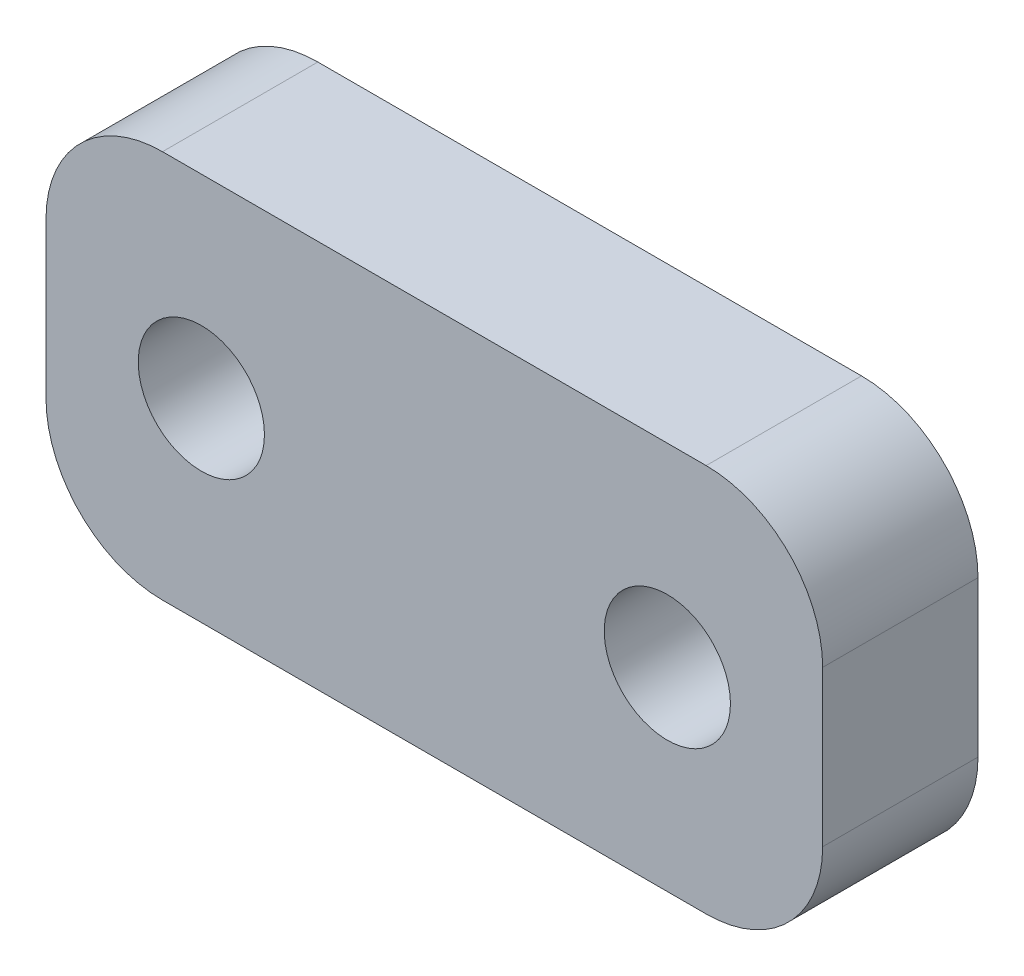
ISO-10303-21;
HEADER;
FILE_DESCRIPTION(('STEP AP214'),'2;1');
FILE_NAME('part.step','',(''),(''),'','','');
FILE_SCHEMA(('AUTOMOTIVE_DESIGN { 1 0 10303 214 1 1 1 1 }'));
ENDSEC;
DATA;
#1=APPLICATION_CONTEXT('core data for automotive mechanical design processes');
#2=APPLICATION_PROTOCOL_DEFINITION('international standard','automotive_design',2000,#1);
#3=PRODUCT_CONTEXT('',#1,'mechanical');
#4=PRODUCT('Part','Part','',(#3));
#5=PRODUCT_RELATED_PRODUCT_CATEGORY('part','',(#4));
#6=PRODUCT_DEFINITION_FORMATION('','',#4);
#7=PRODUCT_DEFINITION_CONTEXT('part definition',#1,'design');
#8=PRODUCT_DEFINITION('design','',#6,#7);
#9=PRODUCT_DEFINITION_SHAPE('','',#8);
#10=(LENGTH_UNIT() NAMED_UNIT(*) SI_UNIT(.MILLI.,.METRE.));
#11=(NAMED_UNIT(*) PLANE_ANGLE_UNIT() SI_UNIT($,.RADIAN.));
#12=(NAMED_UNIT(*) SI_UNIT($,.STERADIAN.) SOLID_ANGLE_UNIT());
#13=UNCERTAINTY_MEASURE_WITH_UNIT(LENGTH_MEASURE(1.E-05),#10,'distance_accuracy_value','');
#14=(GEOMETRIC_REPRESENTATION_CONTEXT(3) GLOBAL_UNCERTAINTY_ASSIGNED_CONTEXT((#13)) GLOBAL_UNIT_ASSIGNED_CONTEXT((#10,
#11,#12)) REPRESENTATION_CONTEXT('',''));
#15=CARTESIAN_POINT('',(0.,0.,0.));
#16=DIRECTION('',(0.,0.,1.));
#17=DIRECTION('',(1.,0.,0.));
#18=AXIS2_PLACEMENT_3D('',#15,#16,#17);
#19=CARTESIAN_POINT('',(0.,0.,4.));
#20=DIRECTION('',(0.,0.,-1.));
#21=DIRECTION('',(-1.,0.,0.));
#22=AXIS2_PLACEMENT_3D('',#19,#20,#21);
#23=PLANE('',#22);
#24=DIRECTION('',(0.,1.,0.));
#25=VECTOR('',#24,1.);
#26=CARTESIAN_POINT('',(10.,-5.00016331863466,4.));
#27=LINE('',#26,#25);
#28=CARTESIAN_POINT('',(10.,-2.00016331863466,4.));
#29=VERTEX_POINT('',#28);
#30=CARTESIAN_POINT('',(10.,2.00016331863466,4.));
#31=VERTEX_POINT('',#30);
#32=EDGE_CURVE('E136',#29,#31,#27,.T.);
#33=ORIENTED_EDGE('',*,*,#32,.T.);
#34=CARTESIAN_POINT('',(7.,2.00016331863466,4.));
#35=DIRECTION('',(0.,0.,-1.));
#36=DIRECTION('',(-1.,0.,0.));
#37=AXIS2_PLACEMENT_3D('',#34,#35,#36);
#38=CIRCLE('',#37,3.);
#39=CARTESIAN_POINT('',(7.,5.00016331863466,4.));
#40=VERTEX_POINT('',#39);
#41=EDGE_CURVE('E151',#31,#40,#38,.F.);
#42=ORIENTED_EDGE('',*,*,#41,.T.);
#43=DIRECTION('',(-1.,0.,0.));
#44=VECTOR('',#43,1.);
#45=CARTESIAN_POINT('',(-10.,5.00016331863466,4.));
#46=LINE('',#45,#44);
#47=CARTESIAN_POINT('',(-7.,5.00016331863466,4.));
#48=VERTEX_POINT('',#47);
#49=EDGE_CURVE('E118',#40,#48,#46,.T.);
#50=ORIENTED_EDGE('',*,*,#49,.T.);
#51=CARTESIAN_POINT('',(-7.,2.00016331863466,4.));
#52=DIRECTION('',(0.,0.,-1.));
#53=DIRECTION('',(-1.,0.,0.));
#54=AXIS2_PLACEMENT_3D('',#51,#52,#53);
#55=CIRCLE('',#54,3.);
#56=CARTESIAN_POINT('',(-10.,2.00016331863466,4.));
#57=VERTEX_POINT('',#56);
#58=EDGE_CURVE('E146',#48,#57,#55,.F.);
#59=ORIENTED_EDGE('',*,*,#58,.T.);
#60=DIRECTION('',(0.,-1.,0.));
#61=VECTOR('',#60,1.);
#62=CARTESIAN_POINT('',(-10.,-5.00016331863466,4.));
#63=LINE('',#62,#61);
#64=CARTESIAN_POINT('',(-10.,-2.00016331863466,4.));
#65=VERTEX_POINT('',#64);
#66=EDGE_CURVE('E162',#57,#65,#63,.T.);
#67=ORIENTED_EDGE('',*,*,#66,.T.);
#68=CARTESIAN_POINT('',(-7.,-2.00016331863466,4.));
#69=DIRECTION('',(0.,0.,-1.));
#70=DIRECTION('',(-1.,0.,0.));
#71=AXIS2_PLACEMENT_3D('',#68,#69,#70);
#72=CIRCLE('',#71,3.);
#73=CARTESIAN_POINT('',(-7.,-5.00016331863466,4.));
#74=VERTEX_POINT('',#73);
#75=EDGE_CURVE('E54',#65,#74,#72,.F.);
#76=ORIENTED_EDGE('',*,*,#75,.T.);
#77=DIRECTION('',(1.,0.,0.));
#78=VECTOR('',#77,1.);
#79=CARTESIAN_POINT('',(-10.,-5.00016331863466,4.));
#80=LINE('',#79,#78);
#81=CARTESIAN_POINT('',(7.,-5.00016331863466,4.));
#82=VERTEX_POINT('',#81);
#83=EDGE_CURVE('E137',#74,#82,#80,.T.);
#84=ORIENTED_EDGE('',*,*,#83,.T.);
#85=CARTESIAN_POINT('',(7.,-2.00016331863466,4.));
#86=DIRECTION('',(0.,0.,-1.));
#87=DIRECTION('',(-1.,0.,0.));
#88=AXIS2_PLACEMENT_3D('',#85,#86,#87);
#89=CIRCLE('',#88,3.);
#90=EDGE_CURVE('E149',#82,#29,#89,.F.);
#91=ORIENTED_EDGE('',*,*,#90,.T.);
#92=EDGE_LOOP('',(#33,#42,#50,#59,#67,#76,#84,#91));
#93=FACE_BOUND('',#92,.T.);
#94=CARTESIAN_POINT('',(-6.,0.,4.));
#95=DIRECTION('',(0.,0.,1.));
#96=DIRECTION('',(1.,0.,0.));
#97=AXIS2_PLACEMENT_3D('',#94,#95,#96);
#98=CIRCLE('',#97,1.625);
#99=CARTESIAN_POINT('',(-4.375,0.,4.));
#100=VERTEX_POINT('',#99);
#101=EDGE_CURVE('E131',#100,#100,#98,.T.);
#102=ORIENTED_EDGE('',*,*,#101,.F.);
#103=EDGE_LOOP('',(#102));
#104=FACE_BOUND('',#103,.T.);
#105=CARTESIAN_POINT('',(6.,0.,4.));
#106=DIRECTION('',(0.,0.,1.));
#107=DIRECTION('',(1.,0.,0.));
#108=AXIS2_PLACEMENT_3D('',#105,#106,#107);
#109=CIRCLE('',#108,1.625);
#110=CARTESIAN_POINT('',(7.625,0.,4.));
#111=VERTEX_POINT('',#110);
#112=EDGE_CURVE('E179',#111,#111,#109,.T.);
#113=ORIENTED_EDGE('',*,*,#112,.F.);
#114=EDGE_LOOP('',(#113));
#115=FACE_BOUND('',#114,.T.);
#116=ADVANCED_FACE('F32',(#93,#104,#115),#23,.F.);
#117=CARTESIAN_POINT('',(0.,0.,0.));
#118=DIRECTION('',(0.,0.,-1.));
#119=DIRECTION('',(-1.,0.,0.));
#120=AXIS2_PLACEMENT_3D('',#117,#118,#119);
#121=PLANE('',#120);
#122=CARTESIAN_POINT('',(-6.,0.,0.));
#123=DIRECTION('',(0.,0.,1.));
#124=DIRECTION('',(1.,0.,0.));
#125=AXIS2_PLACEMENT_3D('',#122,#123,#124);
#126=CIRCLE('',#125,1.625);
#127=CARTESIAN_POINT('',(-4.375,0.,0.));
#128=VERTEX_POINT('',#127);
#129=EDGE_CURVE('E176',#128,#128,#126,.T.);
#130=ORIENTED_EDGE('',*,*,#129,.T.);
#131=EDGE_LOOP('',(#130));
#132=FACE_BOUND('',#131,.T.);
#133=DIRECTION('',(-1.,0.,0.));
#134=VECTOR('',#133,1.);
#135=CARTESIAN_POINT('',(-10.,5.00016331863466,0.));
#136=LINE('',#135,#134);
#137=CARTESIAN_POINT('',(7.,5.00016331863466,0.));
#138=VERTEX_POINT('',#137);
#139=CARTESIAN_POINT('',(-7.,5.00016331863466,0.));
#140=VERTEX_POINT('',#139);
#141=EDGE_CURVE('E115',#138,#140,#136,.T.);
#142=ORIENTED_EDGE('',*,*,#141,.F.);
#143=CARTESIAN_POINT('',(7.,2.00016331863466,0.));
#144=DIRECTION('',(0.,0.,-1.));
#145=DIRECTION('',(-1.,0.,0.));
#146=AXIS2_PLACEMENT_3D('',#143,#144,#145);
#147=CIRCLE('',#146,3.);
#148=CARTESIAN_POINT('',(10.,2.00016331863466,0.));
#149=VERTEX_POINT('',#148);
#150=EDGE_CURVE('E98',#138,#149,#147,.T.);
#151=ORIENTED_EDGE('',*,*,#150,.T.);
#152=DIRECTION('',(0.,1.,0.));
#153=VECTOR('',#152,1.);
#154=CARTESIAN_POINT('',(10.,-5.00016331863466,0.));
#155=LINE('',#154,#153);
#156=CARTESIAN_POINT('',(10.,-2.00016331863466,0.));
#157=VERTEX_POINT('',#156);
#158=EDGE_CURVE('E126',#157,#149,#155,.T.);
#159=ORIENTED_EDGE('',*,*,#158,.F.);
#160=CARTESIAN_POINT('',(7.,-2.00016331863466,0.));
#161=DIRECTION('',(0.,0.,-1.));
#162=DIRECTION('',(-1.,0.,0.));
#163=AXIS2_PLACEMENT_3D('',#160,#161,#162);
#164=CIRCLE('',#163,3.);
#165=CARTESIAN_POINT('',(7.,-5.00016331863466,0.));
#166=VERTEX_POINT('',#165);
#167=EDGE_CURVE('E109',#157,#166,#164,.T.);
#168=ORIENTED_EDGE('',*,*,#167,.T.);
#169=DIRECTION('',(1.,0.,0.));
#170=VECTOR('',#169,1.);
#171=CARTESIAN_POINT('',(-10.,-5.00016331863466,0.));
#172=LINE('',#171,#170);
#173=CARTESIAN_POINT('',(-7.,-5.00016331863466,0.));
#174=VERTEX_POINT('',#173);
#175=EDGE_CURVE('E129',#174,#166,#172,.T.);
#176=ORIENTED_EDGE('',*,*,#175,.F.);
#177=CARTESIAN_POINT('',(-7.,-2.00016331863466,0.));
#178=DIRECTION('',(0.,0.,-1.));
#179=DIRECTION('',(-1.,0.,0.));
#180=AXIS2_PLACEMENT_3D('',#177,#178,#179);
#181=CIRCLE('',#180,3.);
#182=CARTESIAN_POINT('',(-10.,-2.00016331863466,0.));
#183=VERTEX_POINT('',#182);
#184=EDGE_CURVE('E140',#174,#183,#181,.T.);
#185=ORIENTED_EDGE('',*,*,#184,.T.);
#186=DIRECTION('',(0.,-1.,0.));
#187=VECTOR('',#186,1.);
#188=CARTESIAN_POINT('',(-10.,-5.00016331863466,0.));
#189=LINE('',#188,#187);
#190=CARTESIAN_POINT('',(-10.,2.00016331863466,0.));
#191=VERTEX_POINT('',#190);
#192=EDGE_CURVE('E125',#191,#183,#189,.T.);
#193=ORIENTED_EDGE('',*,*,#192,.F.);
#194=CARTESIAN_POINT('',(-7.,2.00016331863466,0.));
#195=DIRECTION('',(0.,0.,-1.));
#196=DIRECTION('',(-1.,0.,0.));
#197=AXIS2_PLACEMENT_3D('',#194,#195,#196);
#198=CIRCLE('',#197,3.);
#199=EDGE_CURVE('E119',#191,#140,#198,.T.);
#200=ORIENTED_EDGE('',*,*,#199,.T.);
#201=EDGE_LOOP('',(#142,#151,#159,#168,#176,#185,#193,#200));
#202=FACE_BOUND('',#201,.T.);
#203=CARTESIAN_POINT('',(6.,0.,0.));
#204=DIRECTION('',(0.,0.,1.));
#205=DIRECTION('',(1.,0.,0.));
#206=AXIS2_PLACEMENT_3D('',#203,#204,#205);
#207=CIRCLE('',#206,1.625);
#208=CARTESIAN_POINT('',(7.625,0.,0.));
#209=VERTEX_POINT('',#208);
#210=EDGE_CURVE('E182',#209,#209,#207,.T.);
#211=ORIENTED_EDGE('',*,*,#210,.T.);
#212=EDGE_LOOP('',(#211));
#213=FACE_BOUND('',#212,.T.);
#214=ADVANCED_FACE('F122',(#132,#202,#213),#121,.T.);
#215=CARTESIAN_POINT('',(10.,-5.00016331863466,4.));
#216=DIRECTION('',(-1.,0.,0.));
#217=DIRECTION('',(0.,0.,1.));
#218=AXIS2_PLACEMENT_3D('',#215,#216,#217);
#219=PLANE('',#218);
#220=ORIENTED_EDGE('',*,*,#158,.T.);
#221=DIRECTION('',(0.,0.,-1.));
#222=VECTOR('',#221,1.);
#223=CARTESIAN_POINT('',(10.,2.00016331863466,4.));
#224=LINE('',#223,#222);
#225=EDGE_CURVE('E103',#149,#31,#224,.F.);
#226=ORIENTED_EDGE('',*,*,#225,.T.);
#227=ORIENTED_EDGE('',*,*,#32,.F.);
#228=DIRECTION('',(0.,0.,-1.));
#229=VECTOR('',#228,1.);
#230=CARTESIAN_POINT('',(10.,-2.00016331863466,4.));
#231=LINE('',#230,#229);
#232=EDGE_CURVE('E108',#29,#157,#231,.T.);
#233=ORIENTED_EDGE('',*,*,#232,.T.);
#234=EDGE_LOOP('',(#220,#226,#227,#233));
#235=FACE_BOUND('',#234,.T.);
#236=ADVANCED_FACE('F197',(#235),#219,.F.);
#237=CARTESIAN_POINT('',(-10.,5.00016331863466,4.));
#238=DIRECTION('',(0.,-1.,0.));
#239=DIRECTION('',(0.,0.,-1.));
#240=AXIS2_PLACEMENT_3D('',#237,#238,#239);
#241=PLANE('',#240);
#242=ORIENTED_EDGE('',*,*,#49,.F.);
#243=DIRECTION('',(0.,0.,-1.));
#244=VECTOR('',#243,1.);
#245=CARTESIAN_POINT('',(7.,5.00016331863466,4.));
#246=LINE('',#245,#244);
#247=EDGE_CURVE('E102',#40,#138,#246,.T.);
#248=ORIENTED_EDGE('',*,*,#247,.T.);
#249=ORIENTED_EDGE('',*,*,#141,.T.);
#250=DIRECTION('',(0.,0.,-1.));
#251=VECTOR('',#250,1.);
#252=CARTESIAN_POINT('',(-7.,5.00016331863466,4.));
#253=LINE('',#252,#251);
#254=EDGE_CURVE('E120',#140,#48,#253,.F.);
#255=ORIENTED_EDGE('',*,*,#254,.T.);
#256=EDGE_LOOP('',(#242,#248,#249,#255));
#257=FACE_BOUND('',#256,.T.);
#258=ADVANCED_FACE('F114',(#257),#241,.F.);
#259=CARTESIAN_POINT('',(-10.,-5.00016331863466,4.));
#260=DIRECTION('',(1.,0.,0.));
#261=DIRECTION('',(0.,0.,-1.));
#262=AXIS2_PLACEMENT_3D('',#259,#260,#261);
#263=PLANE('',#262);
#264=ORIENTED_EDGE('',*,*,#192,.T.);
#265=DIRECTION('',(0.,0.,-1.));
#266=VECTOR('',#265,1.);
#267=CARTESIAN_POINT('',(-10.,-2.00016331863466,4.));
#268=LINE('',#267,#266);
#269=EDGE_CURVE('E11',#183,#65,#268,.F.);
#270=ORIENTED_EDGE('',*,*,#269,.T.);
#271=ORIENTED_EDGE('',*,*,#66,.F.);
#272=DIRECTION('',(0.,0.,-1.));
#273=VECTOR('',#272,1.);
#274=CARTESIAN_POINT('',(-10.,2.00016331863466,4.));
#275=LINE('',#274,#273);
#276=EDGE_CURVE('E40',#57,#191,#275,.T.);
#277=ORIENTED_EDGE('',*,*,#276,.T.);
#278=EDGE_LOOP('',(#264,#270,#271,#277));
#279=FACE_BOUND('',#278,.T.);
#280=ADVANCED_FACE('F160',(#279),#263,.F.);
#281=CARTESIAN_POINT('',(-10.,-5.00016331863466,4.));
#282=DIRECTION('',(0.,1.,0.));
#283=DIRECTION('',(0.,0.,1.));
#284=AXIS2_PLACEMENT_3D('',#281,#282,#283);
#285=PLANE('',#284);
#286=ORIENTED_EDGE('',*,*,#175,.T.);
#287=DIRECTION('',(0.,0.,-1.));
#288=VECTOR('',#287,1.);
#289=CARTESIAN_POINT('',(7.,-5.00016331863466,4.));
#290=LINE('',#289,#288);
#291=EDGE_CURVE('E47',#166,#82,#290,.F.);
#292=ORIENTED_EDGE('',*,*,#291,.T.);
#293=ORIENTED_EDGE('',*,*,#83,.F.);
#294=DIRECTION('',(0.,0.,-1.));
#295=VECTOR('',#294,1.);
#296=CARTESIAN_POINT('',(-7.,-5.00016331863466,4.));
#297=LINE('',#296,#295);
#298=EDGE_CURVE('E153',#74,#174,#297,.T.);
#299=ORIENTED_EDGE('',*,*,#298,.T.);
#300=EDGE_LOOP('',(#286,#292,#293,#299));
#301=FACE_BOUND('',#300,.T.);
#302=ADVANCED_FACE('F169',(#301),#285,.F.);
#303=CARTESIAN_POINT('',(-6.,0.,4.));
#304=DIRECTION('',(0.,0.,-1.));
#305=DIRECTION('',(-1.,0.,0.));
#306=AXIS2_PLACEMENT_3D('',#303,#304,#305);
#307=CYLINDRICAL_SURFACE('',#306,1.625);
#308=ORIENTED_EDGE('',*,*,#101,.T.);
#309=EDGE_LOOP('',(#308));
#310=FACE_BOUND('',#309,.T.);
#311=ORIENTED_EDGE('',*,*,#129,.F.);
#312=EDGE_LOOP('',(#311));
#313=FACE_BOUND('',#312,.T.);
#314=ADVANCED_FACE('F202',(#310,#313),#307,.F.);
#315=CARTESIAN_POINT('',(6.,0.,4.));
#316=DIRECTION('',(0.,0.,-1.));
#317=DIRECTION('',(-1.,0.,0.));
#318=AXIS2_PLACEMENT_3D('',#315,#316,#317);
#319=CYLINDRICAL_SURFACE('',#318,1.625);
#320=ORIENTED_EDGE('',*,*,#112,.T.);
#321=EDGE_LOOP('',(#320));
#322=FACE_BOUND('',#321,.T.);
#323=ORIENTED_EDGE('',*,*,#210,.F.);
#324=EDGE_LOOP('',(#323));
#325=FACE_BOUND('',#324,.T.);
#326=ADVANCED_FACE('F188',(#322,#325),#319,.F.);
#327=CARTESIAN_POINT('',(7.,2.00016331863466,4.));
#328=DIRECTION('',(0.,0.,-1.));
#329=DIRECTION('',(-1.,0.,0.));
#330=AXIS2_PLACEMENT_3D('',#327,#328,#329);
#331=CYLINDRICAL_SURFACE('',#330,3.);
#332=ORIENTED_EDGE('',*,*,#41,.F.);
#333=ORIENTED_EDGE('',*,*,#225,.F.);
#334=ORIENTED_EDGE('',*,*,#150,.F.);
#335=ORIENTED_EDGE('',*,*,#247,.F.);
#336=EDGE_LOOP('',(#332,#333,#334,#335));
#337=FACE_BOUND('',#336,.T.);
#338=ADVANCED_FACE('F101',(#337),#331,.T.);
#339=CARTESIAN_POINT('',(7.,-2.00016331863466,4.));
#340=DIRECTION('',(0.,0.,-1.));
#341=DIRECTION('',(-1.,0.,0.));
#342=AXIS2_PLACEMENT_3D('',#339,#340,#341);
#343=CYLINDRICAL_SURFACE('',#342,3.);
#344=ORIENTED_EDGE('',*,*,#90,.F.);
#345=ORIENTED_EDGE('',*,*,#291,.F.);
#346=ORIENTED_EDGE('',*,*,#167,.F.);
#347=ORIENTED_EDGE('',*,*,#232,.F.);
#348=EDGE_LOOP('',(#344,#345,#346,#347));
#349=FACE_BOUND('',#348,.T.);
#350=ADVANCED_FACE('F216',(#349),#343,.T.);
#351=CARTESIAN_POINT('',(-7.,-2.00016331863466,4.));
#352=DIRECTION('',(0.,0.,-1.));
#353=DIRECTION('',(-1.,0.,0.));
#354=AXIS2_PLACEMENT_3D('',#351,#352,#353);
#355=CYLINDRICAL_SURFACE('',#354,3.);
#356=ORIENTED_EDGE('',*,*,#75,.F.);
#357=ORIENTED_EDGE('',*,*,#269,.F.);
#358=ORIENTED_EDGE('',*,*,#184,.F.);
#359=ORIENTED_EDGE('',*,*,#298,.F.);
#360=EDGE_LOOP('',(#356,#357,#358,#359));
#361=FACE_BOUND('',#360,.T.);
#362=ADVANCED_FACE('F168',(#361),#355,.T.);
#363=CARTESIAN_POINT('',(-7.,2.00016331863466,4.));
#364=DIRECTION('',(0.,0.,-1.));
#365=DIRECTION('',(-1.,0.,0.));
#366=AXIS2_PLACEMENT_3D('',#363,#364,#365);
#367=CYLINDRICAL_SURFACE('',#366,3.);
#368=ORIENTED_EDGE('',*,*,#58,.F.);
#369=ORIENTED_EDGE('',*,*,#254,.F.);
#370=ORIENTED_EDGE('',*,*,#199,.F.);
#371=ORIENTED_EDGE('',*,*,#276,.F.);
#372=EDGE_LOOP('',(#368,#369,#370,#371));
#373=FACE_BOUND('',#372,.T.);
#374=ADVANCED_FACE('F34',(#373),#367,.T.);
#375=CLOSED_SHELL('',(#116,#214,#236,#258,#280,#302,#314,#326,#338,#350,#362,#374));
#376=MANIFOLD_SOLID_BREP('B2',#375);
#377=ADVANCED_BREP_SHAPE_REPRESENTATION('',(#18,#376),#14);
#378=SHAPE_DEFINITION_REPRESENTATION(#9,#377);
ENDSEC;
END-ISO-10303-21;
